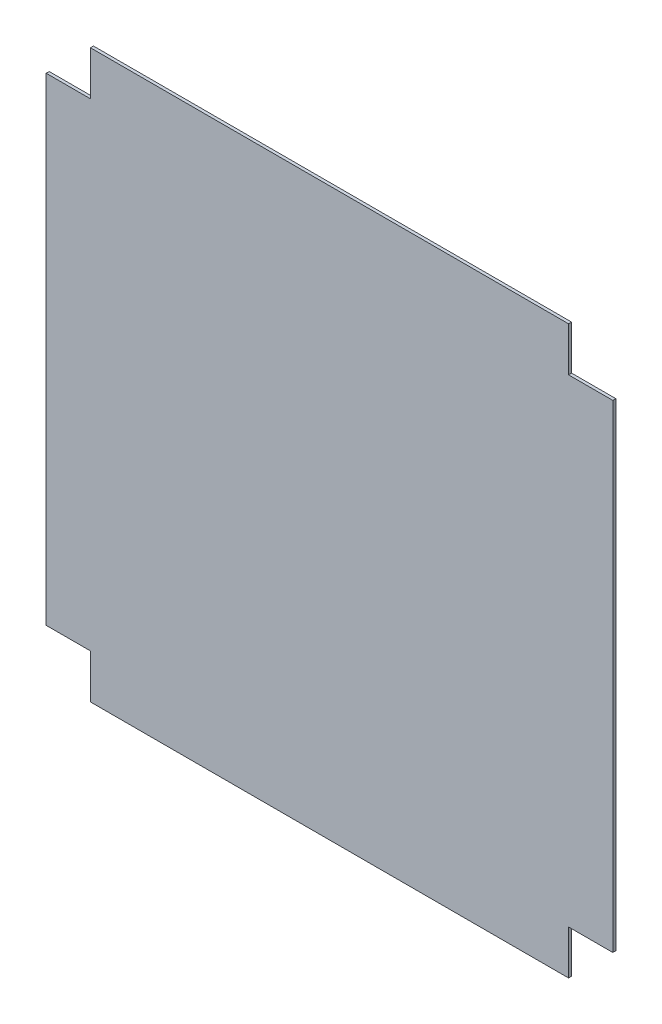
ISO-10303-21;
HEADER;
FILE_DESCRIPTION(('STEP AP214'),'2;1');
FILE_NAME('part.step','',(''),(''),'','','');
FILE_SCHEMA(('AUTOMOTIVE_DESIGN { 1 0 10303 214 1 1 1 1 }'));
ENDSEC;
DATA;
#1=APPLICATION_CONTEXT('core data for automotive mechanical design processes');
#2=APPLICATION_PROTOCOL_DEFINITION('international standard','automotive_design',2000,#1);
#3=PRODUCT_CONTEXT('',#1,'mechanical');
#4=PRODUCT('Part','Part','',(#3));
#5=PRODUCT_RELATED_PRODUCT_CATEGORY('part','',(#4));
#6=PRODUCT_DEFINITION_FORMATION('','',#4);
#7=PRODUCT_DEFINITION_CONTEXT('part definition',#1,'design');
#8=PRODUCT_DEFINITION('design','',#6,#7);
#9=PRODUCT_DEFINITION_SHAPE('','',#8);
#10=(LENGTH_UNIT() NAMED_UNIT(*) SI_UNIT(.MILLI.,.METRE.));
#11=(NAMED_UNIT(*) PLANE_ANGLE_UNIT() SI_UNIT($,.RADIAN.));
#12=(NAMED_UNIT(*) SI_UNIT($,.STERADIAN.) SOLID_ANGLE_UNIT());
#13=UNCERTAINTY_MEASURE_WITH_UNIT(LENGTH_MEASURE(1.E-05),#10,'distance_accuracy_value','');
#14=(GEOMETRIC_REPRESENTATION_CONTEXT(3) GLOBAL_UNCERTAINTY_ASSIGNED_CONTEXT((#13)) GLOBAL_UNIT_ASSIGNED_CONTEXT((#10,
#11,#12)) REPRESENTATION_CONTEXT('',''));
#15=CARTESIAN_POINT('',(0.,0.,0.));
#16=DIRECTION('',(0.,0.,1.));
#17=DIRECTION('',(1.,0.,0.));
#18=AXIS2_PLACEMENT_3D('',#15,#16,#17);
#19=CARTESIAN_POINT('',(-80.9329982140835,58.7953667953668,1.5));
#20=DIRECTION('',(1.,0.,0.));
#21=DIRECTION('',(0.,0.,-1.));
#22=AXIS2_PLACEMENT_3D('',#19,#20,#21);
#23=PLANE('',#22);
#24=DIRECTION('',(0.,-1.,0.));
#25=VECTOR('',#24,1.);
#26=CARTESIAN_POINT('',(-80.9329982140835,58.7953667953668,0.));
#27=LINE('',#26,#25);
#28=CARTESIAN_POINT('',(-80.9329982140835,58.7953667953668,0.));
#29=VERTEX_POINT('',#28);
#30=CARTESIAN_POINT('',(-80.9329982140835,36.7953667953668,0.));
#31=VERTEX_POINT('',#30);
#32=EDGE_CURVE('E164',#29,#31,#27,.T.);
#33=ORIENTED_EDGE('',*,*,#32,.T.);
#34=DIRECTION('',(0.,0.,-1.));
#35=VECTOR('',#34,1.);
#36=CARTESIAN_POINT('',(-80.9329982140835,36.7953667953668,1.5));
#37=LINE('',#36,#35);
#38=CARTESIAN_POINT('',(-80.9329982140835,36.7953667953668,1.5));
#39=VERTEX_POINT('',#38);
#40=EDGE_CURVE('E11',#39,#31,#37,.T.);
#41=ORIENTED_EDGE('',*,*,#40,.F.);
#42=DIRECTION('',(0.,-1.,0.));
#43=VECTOR('',#42,1.);
#44=CARTESIAN_POINT('',(-80.9329982140835,58.7953667953668,1.5));
#45=LINE('',#44,#43);
#46=CARTESIAN_POINT('',(-80.9329982140835,58.7953667953668,1.5));
#47=VERTEX_POINT('',#46);
#48=EDGE_CURVE('E198',#47,#39,#45,.T.);
#49=ORIENTED_EDGE('',*,*,#48,.F.);
#50=DIRECTION('',(0.,0.,-1.));
#51=VECTOR('',#50,1.);
#52=CARTESIAN_POINT('',(-80.9329982140835,58.7953667953668,1.5));
#53=LINE('',#52,#51);
#54=EDGE_CURVE('E160',#47,#29,#53,.T.);
#55=ORIENTED_EDGE('',*,*,#54,.T.);
#56=EDGE_LOOP('',(#33,#41,#49,#55));
#57=FACE_BOUND('',#56,.T.);
#58=ADVANCED_FACE('F39',(#57),#23,.F.);
#59=CARTESIAN_POINT('',(-102.932998214083,36.7953667953668,1.5));
#60=DIRECTION('',(0.,-1.,0.));
#61=DIRECTION('',(0.,0.,-1.));
#62=AXIS2_PLACEMENT_3D('',#59,#60,#61);
#63=PLANE('',#62);
#64=DIRECTION('',(-1.,0.,0.));
#65=VECTOR('',#64,1.);
#66=CARTESIAN_POINT('',(-102.932998214083,36.7953667953668,0.));
#67=LINE('',#66,#65);
#68=CARTESIAN_POINT('',(-102.932998214083,36.7953667953668,0.));
#69=VERTEX_POINT('',#68);
#70=EDGE_CURVE('E168',#31,#69,#67,.T.);
#71=ORIENTED_EDGE('',*,*,#70,.T.);
#72=DIRECTION('',(0.,0.,-1.));
#73=VECTOR('',#72,1.);
#74=CARTESIAN_POINT('',(-102.932998214083,36.7953667953668,1.5));
#75=LINE('',#74,#73);
#76=CARTESIAN_POINT('',(-102.932998214083,36.7953667953668,1.5));
#77=VERTEX_POINT('',#76);
#78=EDGE_CURVE('E48',#77,#69,#75,.T.);
#79=ORIENTED_EDGE('',*,*,#78,.F.);
#80=DIRECTION('',(-1.,0.,0.));
#81=VECTOR('',#80,1.);
#82=CARTESIAN_POINT('',(-102.932998214083,36.7953667953668,1.5));
#83=LINE('',#82,#81);
#84=EDGE_CURVE('E111',#39,#77,#83,.T.);
#85=ORIENTED_EDGE('',*,*,#84,.F.);
#86=ORIENTED_EDGE('',*,*,#40,.T.);
#87=EDGE_LOOP('',(#71,#79,#85,#86));
#88=FACE_BOUND('',#87,.T.);
#89=ADVANCED_FACE('F292',(#88),#63,.F.);
#90=CARTESIAN_POINT('',(-102.932998214083,36.7953667953668,1.5));
#91=DIRECTION('',(1.,0.,0.));
#92=DIRECTION('',(0.,1.,0.));
#93=AXIS2_PLACEMENT_3D('',#90,#91,#92);
#94=PLANE('',#93);
#95=DIRECTION('',(0.,-1.,0.));
#96=VECTOR('',#95,1.);
#97=CARTESIAN_POINT('',(-102.932998214083,36.7953667953668,0.));
#98=LINE('',#97,#96);
#99=CARTESIAN_POINT('',(-102.932998214083,-201.204633204633,0.));
#100=VERTEX_POINT('',#99);
#101=EDGE_CURVE('E171',#69,#100,#98,.T.);
#102=ORIENTED_EDGE('',*,*,#101,.T.);
#103=DIRECTION('',(0.,0.,-1.));
#104=VECTOR('',#103,1.);
#105=CARTESIAN_POINT('',(-102.932998214083,-201.204633204633,1.5));
#106=LINE('',#105,#104);
#107=CARTESIAN_POINT('',(-102.932998214083,-201.204633204633,1.5));
#108=VERTEX_POINT('',#107);
#109=EDGE_CURVE('E225',#108,#100,#106,.T.);
#110=ORIENTED_EDGE('',*,*,#109,.F.);
#111=DIRECTION('',(0.,-1.,0.));
#112=VECTOR('',#111,1.);
#113=CARTESIAN_POINT('',(-102.932998214083,36.7953667953668,1.5));
#114=LINE('',#113,#112);
#115=EDGE_CURVE('E235',#77,#108,#114,.T.);
#116=ORIENTED_EDGE('',*,*,#115,.F.);
#117=ORIENTED_EDGE('',*,*,#78,.T.);
#118=EDGE_LOOP('',(#102,#110,#116,#117));
#119=FACE_BOUND('',#118,.T.);
#120=ADVANCED_FACE('F233',(#119),#94,.F.);
#121=CARTESIAN_POINT('',(-102.932998214083,-201.204633204633,1.5));
#122=DIRECTION('',(0.,1.,0.));
#123=DIRECTION('',(0.,0.,1.));
#124=AXIS2_PLACEMENT_3D('',#121,#122,#123);
#125=PLANE('',#124);
#126=DIRECTION('',(1.,0.,0.));
#127=VECTOR('',#126,1.);
#128=CARTESIAN_POINT('',(-102.932998214083,-201.204633204633,0.));
#129=LINE('',#128,#127);
#130=CARTESIAN_POINT('',(-80.9329982140834,-201.204633204633,0.));
#131=VERTEX_POINT('',#130);
#132=EDGE_CURVE('E174',#100,#131,#129,.T.);
#133=ORIENTED_EDGE('',*,*,#132,.T.);
#134=DIRECTION('',(0.,0.,-1.));
#135=VECTOR('',#134,1.);
#136=CARTESIAN_POINT('',(-80.9329982140834,-201.204633204633,1.5));
#137=LINE('',#136,#135);
#138=CARTESIAN_POINT('',(-80.9329982140834,-201.204633204633,1.5));
#139=VERTEX_POINT('',#138);
#140=EDGE_CURVE('E221',#139,#131,#137,.T.);
#141=ORIENTED_EDGE('',*,*,#140,.F.);
#142=DIRECTION('',(1.,0.,0.));
#143=VECTOR('',#142,1.);
#144=CARTESIAN_POINT('',(-102.932998214083,-201.204633204633,1.5));
#145=LINE('',#144,#143);
#146=EDGE_CURVE('E254',#108,#139,#145,.T.);
#147=ORIENTED_EDGE('',*,*,#146,.F.);
#148=ORIENTED_EDGE('',*,*,#109,.T.);
#149=EDGE_LOOP('',(#133,#141,#147,#148));
#150=FACE_BOUND('',#149,.T.);
#151=ADVANCED_FACE('F244',(#150),#125,.F.);
#152=CARTESIAN_POINT('',(-80.9329982140834,-223.204633204633,1.5));
#153=DIRECTION('',(1.,0.,0.));
#154=DIRECTION('',(0.,1.,0.));
#155=AXIS2_PLACEMENT_3D('',#152,#153,#154);
#156=PLANE('',#155);
#157=DIRECTION('',(0.,-1.,0.));
#158=VECTOR('',#157,1.);
#159=CARTESIAN_POINT('',(-80.9329982140834,-223.204633204633,0.));
#160=LINE('',#159,#158);
#161=CARTESIAN_POINT('',(-80.9329982140834,-223.204633204633,0.));
#162=VERTEX_POINT('',#161);
#163=EDGE_CURVE('E177',#131,#162,#160,.T.);
#164=ORIENTED_EDGE('',*,*,#163,.T.);
#165=DIRECTION('',(0.,0.,-1.));
#166=VECTOR('',#165,1.);
#167=CARTESIAN_POINT('',(-80.9329982140834,-223.204633204633,1.5));
#168=LINE('',#167,#166);
#169=CARTESIAN_POINT('',(-80.9329982140834,-223.204633204633,1.5));
#170=VERTEX_POINT('',#169);
#171=EDGE_CURVE('E217',#170,#162,#168,.T.);
#172=ORIENTED_EDGE('',*,*,#171,.F.);
#173=DIRECTION('',(0.,-1.,0.));
#174=VECTOR('',#173,1.);
#175=CARTESIAN_POINT('',(-80.9329982140834,-223.204633204633,1.5));
#176=LINE('',#175,#174);
#177=EDGE_CURVE('E250',#139,#170,#176,.T.);
#178=ORIENTED_EDGE('',*,*,#177,.F.);
#179=ORIENTED_EDGE('',*,*,#140,.T.);
#180=EDGE_LOOP('',(#164,#172,#178,#179));
#181=FACE_BOUND('',#180,.T.);
#182=ADVANCED_FACE('F248',(#181),#156,.F.);
#183=CARTESIAN_POINT('',(-80.9329982140834,-223.204633204633,1.5));
#184=DIRECTION('',(0.,1.,0.));
#185=DIRECTION('',(-1.,0.,0.));
#186=AXIS2_PLACEMENT_3D('',#183,#184,#185);
#187=PLANE('',#186);
#188=DIRECTION('',(1.,0.,0.));
#189=VECTOR('',#188,1.);
#190=CARTESIAN_POINT('',(-80.9329982140834,-223.204633204633,0.));
#191=LINE('',#190,#189);
#192=CARTESIAN_POINT('',(157.067001785917,-223.204633204633,0.));
#193=VERTEX_POINT('',#192);
#194=EDGE_CURVE('E180',#162,#193,#191,.T.);
#195=ORIENTED_EDGE('',*,*,#194,.T.);
#196=DIRECTION('',(0.,0.,-1.));
#197=VECTOR('',#196,1.);
#198=CARTESIAN_POINT('',(157.067001785917,-223.204633204633,1.5));
#199=LINE('',#198,#197);
#200=CARTESIAN_POINT('',(157.067001785917,-223.204633204633,1.5));
#201=VERTEX_POINT('',#200);
#202=EDGE_CURVE('E213',#201,#193,#199,.T.);
#203=ORIENTED_EDGE('',*,*,#202,.F.);
#204=DIRECTION('',(1.,0.,0.));
#205=VECTOR('',#204,1.);
#206=CARTESIAN_POINT('',(-80.9329982140834,-223.204633204633,1.5));
#207=LINE('',#206,#205);
#208=EDGE_CURVE('E253',#170,#201,#207,.T.);
#209=ORIENTED_EDGE('',*,*,#208,.F.);
#210=ORIENTED_EDGE('',*,*,#171,.T.);
#211=EDGE_LOOP('',(#195,#203,#209,#210));
#212=FACE_BOUND('',#211,.T.);
#213=ADVANCED_FACE('F305',(#212),#187,.F.);
#214=CARTESIAN_POINT('',(157.067001785917,-223.204633204633,1.5));
#215=DIRECTION('',(-1.,0.,0.));
#216=DIRECTION('',(0.,-1.,0.));
#217=AXIS2_PLACEMENT_3D('',#214,#215,#216);
#218=PLANE('',#217);
#219=DIRECTION('',(0.,1.,0.));
#220=VECTOR('',#219,1.);
#221=CARTESIAN_POINT('',(157.067001785917,-223.204633204633,0.));
#222=LINE('',#221,#220);
#223=CARTESIAN_POINT('',(157.067001785917,-201.204633204633,0.));
#224=VERTEX_POINT('',#223);
#225=EDGE_CURVE('E183',#193,#224,#222,.T.);
#226=ORIENTED_EDGE('',*,*,#225,.T.);
#227=DIRECTION('',(0.,0.,-1.));
#228=VECTOR('',#227,1.);
#229=CARTESIAN_POINT('',(157.067001785917,-201.204633204633,1.5));
#230=LINE('',#229,#228);
#231=CARTESIAN_POINT('',(157.067001785917,-201.204633204633,1.5));
#232=VERTEX_POINT('',#231);
#233=EDGE_CURVE('E209',#232,#224,#230,.T.);
#234=ORIENTED_EDGE('',*,*,#233,.F.);
#235=DIRECTION('',(0.,1.,0.));
#236=VECTOR('',#235,1.);
#237=CARTESIAN_POINT('',(157.067001785917,-223.204633204633,1.5));
#238=LINE('',#237,#236);
#239=EDGE_CURVE('E258',#201,#232,#238,.T.);
#240=ORIENTED_EDGE('',*,*,#239,.F.);
#241=ORIENTED_EDGE('',*,*,#202,.T.);
#242=EDGE_LOOP('',(#226,#234,#240,#241));
#243=FACE_BOUND('',#242,.T.);
#244=ADVANCED_FACE('F308',(#243),#218,.F.);
#245=CARTESIAN_POINT('',(179.067001785917,-201.204633204633,1.5));
#246=DIRECTION('',(0.,1.,0.));
#247=DIRECTION('',(0.,0.,1.));
#248=AXIS2_PLACEMENT_3D('',#245,#246,#247);
#249=PLANE('',#248);
#250=DIRECTION('',(1.,0.,0.));
#251=VECTOR('',#250,1.);
#252=CARTESIAN_POINT('',(179.067001785917,-201.204633204633,0.));
#253=LINE('',#252,#251);
#254=CARTESIAN_POINT('',(179.067001785917,-201.204633204633,0.));
#255=VERTEX_POINT('',#254);
#256=EDGE_CURVE('E186',#224,#255,#253,.T.);
#257=ORIENTED_EDGE('',*,*,#256,.T.);
#258=DIRECTION('',(0.,0.,-1.));
#259=VECTOR('',#258,1.);
#260=CARTESIAN_POINT('',(179.067001785917,-201.204633204633,1.5));
#261=LINE('',#260,#259);
#262=CARTESIAN_POINT('',(179.067001785917,-201.204633204633,1.5));
#263=VERTEX_POINT('',#262);
#264=EDGE_CURVE('E205',#263,#255,#261,.T.);
#265=ORIENTED_EDGE('',*,*,#264,.F.);
#266=DIRECTION('',(1.,0.,0.));
#267=VECTOR('',#266,1.);
#268=CARTESIAN_POINT('',(179.067001785917,-201.204633204633,1.5));
#269=LINE('',#268,#267);
#270=EDGE_CURVE('E265',#232,#263,#269,.T.);
#271=ORIENTED_EDGE('',*,*,#270,.F.);
#272=ORIENTED_EDGE('',*,*,#233,.T.);
#273=EDGE_LOOP('',(#257,#265,#271,#272));
#274=FACE_BOUND('',#273,.T.);
#275=ADVANCED_FACE('F273',(#274),#249,.F.);
#276=CARTESIAN_POINT('',(179.067001785916,36.7953667953668,1.5));
#277=DIRECTION('',(-1.,0.,0.));
#278=DIRECTION('',(0.,-1.,0.));
#279=AXIS2_PLACEMENT_3D('',#276,#277,#278);
#280=PLANE('',#279);
#281=DIRECTION('',(0.,1.,0.));
#282=VECTOR('',#281,1.);
#283=CARTESIAN_POINT('',(179.067001785916,36.7953667953668,0.));
#284=LINE('',#283,#282);
#285=CARTESIAN_POINT('',(179.067001785916,36.7953667953668,0.));
#286=VERTEX_POINT('',#285);
#287=EDGE_CURVE('E189',#255,#286,#284,.T.);
#288=ORIENTED_EDGE('',*,*,#287,.T.);
#289=DIRECTION('',(0.,0.,-1.));
#290=VECTOR('',#289,1.);
#291=CARTESIAN_POINT('',(179.067001785916,36.7953667953668,1.5));
#292=LINE('',#291,#290);
#293=CARTESIAN_POINT('',(179.067001785916,36.7953667953668,1.5));
#294=VERTEX_POINT('',#293);
#295=EDGE_CURVE('E153',#294,#286,#292,.T.);
#296=ORIENTED_EDGE('',*,*,#295,.F.);
#297=DIRECTION('',(0.,1.,0.));
#298=VECTOR('',#297,1.);
#299=CARTESIAN_POINT('',(179.067001785916,36.7953667953668,1.5));
#300=LINE('',#299,#298);
#301=EDGE_CURVE('E142',#263,#294,#300,.T.);
#302=ORIENTED_EDGE('',*,*,#301,.F.);
#303=ORIENTED_EDGE('',*,*,#264,.T.);
#304=EDGE_LOOP('',(#288,#296,#302,#303));
#305=FACE_BOUND('',#304,.T.);
#306=ADVANCED_FACE('F277',(#305),#280,.F.);
#307=CARTESIAN_POINT('',(179.067001785916,36.7953667953668,1.5));
#308=DIRECTION('',(0.,-1.,0.));
#309=DIRECTION('',(1.,0.,0.));
#310=AXIS2_PLACEMENT_3D('',#307,#308,#309);
#311=PLANE('',#310);
#312=DIRECTION('',(-1.,0.,0.));
#313=VECTOR('',#312,1.);
#314=CARTESIAN_POINT('',(179.067001785916,36.7953667953668,0.));
#315=LINE('',#314,#313);
#316=CARTESIAN_POINT('',(157.067001785917,36.7953667953668,0.));
#317=VERTEX_POINT('',#316);
#318=EDGE_CURVE('E151',#286,#317,#315,.T.);
#319=ORIENTED_EDGE('',*,*,#318,.T.);
#320=DIRECTION('',(0.,0.,-1.));
#321=VECTOR('',#320,1.);
#322=CARTESIAN_POINT('',(157.067001785917,36.7953667953668,1.5));
#323=LINE('',#322,#321);
#324=CARTESIAN_POINT('',(157.067001785917,36.7953667953668,1.5));
#325=VERTEX_POINT('',#324);
#326=EDGE_CURVE('E148',#325,#317,#323,.T.);
#327=ORIENTED_EDGE('',*,*,#326,.F.);
#328=DIRECTION('',(-1.,0.,0.));
#329=VECTOR('',#328,1.);
#330=CARTESIAN_POINT('',(179.067001785916,36.7953667953668,1.5));
#331=LINE('',#330,#329);
#332=EDGE_CURVE('E136',#294,#325,#331,.T.);
#333=ORIENTED_EDGE('',*,*,#332,.F.);
#334=ORIENTED_EDGE('',*,*,#295,.T.);
#335=EDGE_LOOP('',(#319,#327,#333,#334));
#336=FACE_BOUND('',#335,.T.);
#337=ADVANCED_FACE('F149',(#336),#311,.F.);
#338=CARTESIAN_POINT('',(157.067001785917,58.7953667953668,1.5));
#339=DIRECTION('',(-1.,0.,0.));
#340=DIRECTION('',(0.,0.,1.));
#341=AXIS2_PLACEMENT_3D('',#338,#339,#340);
#342=PLANE('',#341);
#343=DIRECTION('',(0.,1.,0.));
#344=VECTOR('',#343,1.);
#345=CARTESIAN_POINT('',(157.067001785917,58.7953667953668,0.));
#346=LINE('',#345,#344);
#347=CARTESIAN_POINT('',(157.067001785917,58.7953667953668,0.));
#348=VERTEX_POINT('',#347);
#349=EDGE_CURVE('E97',#317,#348,#346,.T.);
#350=ORIENTED_EDGE('',*,*,#349,.T.);
#351=DIRECTION('',(0.,0.,-1.));
#352=VECTOR('',#351,1.);
#353=CARTESIAN_POINT('',(157.067001785917,58.7953667953668,1.5));
#354=LINE('',#353,#352);
#355=CARTESIAN_POINT('',(157.067001785917,58.7953667953668,1.5));
#356=VERTEX_POINT('',#355);
#357=EDGE_CURVE('E154',#356,#348,#354,.T.);
#358=ORIENTED_EDGE('',*,*,#357,.F.);
#359=DIRECTION('',(0.,1.,0.));
#360=VECTOR('',#359,1.);
#361=CARTESIAN_POINT('',(157.067001785917,58.7953667953668,1.5));
#362=LINE('',#361,#360);
#363=EDGE_CURVE('E140',#325,#356,#362,.T.);
#364=ORIENTED_EDGE('',*,*,#363,.F.);
#365=ORIENTED_EDGE('',*,*,#326,.T.);
#366=EDGE_LOOP('',(#350,#358,#364,#365));
#367=FACE_BOUND('',#366,.T.);
#368=ADVANCED_FACE('F156',(#367),#342,.F.);
#369=CARTESIAN_POINT('',(-80.9329982140835,58.7953667953668,1.5));
#370=DIRECTION('',(0.,-1.,0.));
#371=DIRECTION('',(1.,0.,0.));
#372=AXIS2_PLACEMENT_3D('',#369,#370,#371);
#373=PLANE('',#372);
#374=DIRECTION('',(-1.,0.,0.));
#375=VECTOR('',#374,1.);
#376=CARTESIAN_POINT('',(-80.9329982140835,58.7953667953668,0.));
#377=LINE('',#376,#375);
#378=EDGE_CURVE('E103',#348,#29,#377,.T.);
#379=ORIENTED_EDGE('',*,*,#378,.T.);
#380=ORIENTED_EDGE('',*,*,#54,.F.);
#381=DIRECTION('',(-1.,0.,0.));
#382=VECTOR('',#381,1.);
#383=CARTESIAN_POINT('',(-80.9329982140835,58.7953667953668,1.5));
#384=LINE('',#383,#382);
#385=EDGE_CURVE('E56',#356,#47,#384,.T.);
#386=ORIENTED_EDGE('',*,*,#385,.F.);
#387=ORIENTED_EDGE('',*,*,#357,.T.);
#388=EDGE_LOOP('',(#379,#380,#386,#387));
#389=FACE_BOUND('',#388,.T.);
#390=ADVANCED_FACE('F281',(#389),#373,.F.);
#391=CARTESIAN_POINT('',(0.,0.,1.5));
#392=DIRECTION('',(0.,0.,1.));
#393=DIRECTION('',(1.,0.,0.));
#394=AXIS2_PLACEMENT_3D('',#391,#392,#393);
#395=PLANE('',#394);
#396=ORIENTED_EDGE('',*,*,#48,.T.);
#397=ORIENTED_EDGE('',*,*,#84,.T.);
#398=ORIENTED_EDGE('',*,*,#115,.T.);
#399=ORIENTED_EDGE('',*,*,#146,.T.);
#400=ORIENTED_EDGE('',*,*,#177,.T.);
#401=ORIENTED_EDGE('',*,*,#208,.T.);
#402=ORIENTED_EDGE('',*,*,#239,.T.);
#403=ORIENTED_EDGE('',*,*,#270,.T.);
#404=ORIENTED_EDGE('',*,*,#301,.T.);
#405=ORIENTED_EDGE('',*,*,#332,.T.);
#406=ORIENTED_EDGE('',*,*,#363,.T.);
#407=ORIENTED_EDGE('',*,*,#385,.T.);
#408=EDGE_LOOP('',(#396,#397,#398,#399,#400,#401,#402,#403,#404,#405,#406,#407));
#409=FACE_BOUND('',#408,.T.);
#410=ADVANCED_FACE('F138',(#409),#395,.T.);
#411=CARTESIAN_POINT('',(0.,0.,0.));
#412=DIRECTION('',(0.,0.,1.));
#413=DIRECTION('',(1.,0.,0.));
#414=AXIS2_PLACEMENT_3D('',#411,#412,#413);
#415=PLANE('',#414);
#416=ORIENTED_EDGE('',*,*,#32,.F.);
#417=ORIENTED_EDGE('',*,*,#378,.F.);
#418=ORIENTED_EDGE('',*,*,#349,.F.);
#419=ORIENTED_EDGE('',*,*,#318,.F.);
#420=ORIENTED_EDGE('',*,*,#287,.F.);
#421=ORIENTED_EDGE('',*,*,#256,.F.);
#422=ORIENTED_EDGE('',*,*,#225,.F.);
#423=ORIENTED_EDGE('',*,*,#194,.F.);
#424=ORIENTED_EDGE('',*,*,#163,.F.);
#425=ORIENTED_EDGE('',*,*,#132,.F.);
#426=ORIENTED_EDGE('',*,*,#101,.F.);
#427=ORIENTED_EDGE('',*,*,#70,.F.);
#428=EDGE_LOOP('',(#416,#417,#418,#419,#420,#421,#422,#423,#424,#425,#426,#427));
#429=FACE_BOUND('',#428,.T.);
#430=ADVANCED_FACE('F239',(#429),#415,.F.);
#431=CLOSED_SHELL('',(#58,#89,#120,#151,#182,#213,#244,#275,#306,#337,#368,#390,#410,#430));
#432=MANIFOLD_SOLID_BREP('B2',#431);
#433=ADVANCED_BREP_SHAPE_REPRESENTATION('',(#18,#432),#14);
#434=SHAPE_DEFINITION_REPRESENTATION(#9,#433);
ENDSEC;
END-ISO-10303-21;
